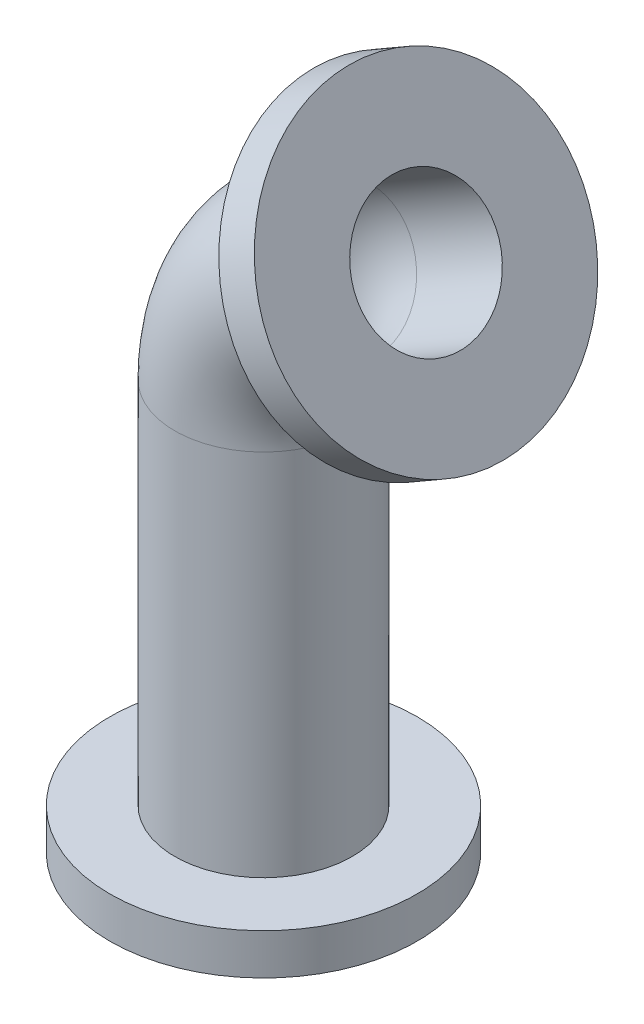
ISO-10303-21;
HEADER;
FILE_DESCRIPTION(('STEP AP214'),'2;1');
FILE_NAME('part.step','',(''),(''),'','','');
FILE_SCHEMA(('AUTOMOTIVE_DESIGN { 1 0 10303 214 1 1 1 1 }'));
ENDSEC;
DATA;
#1=APPLICATION_CONTEXT('core data for automotive mechanical design processes');
#2=APPLICATION_PROTOCOL_DEFINITION('international standard','automotive_design',2000,#1);
#3=PRODUCT_CONTEXT('',#1,'mechanical');
#4=PRODUCT('Part','Part','',(#3));
#5=PRODUCT_RELATED_PRODUCT_CATEGORY('part','',(#4));
#6=PRODUCT_DEFINITION_FORMATION('','',#4);
#7=PRODUCT_DEFINITION_CONTEXT('part definition',#1,'design');
#8=PRODUCT_DEFINITION('design','',#6,#7);
#9=PRODUCT_DEFINITION_SHAPE('','',#8);
#10=(LENGTH_UNIT() NAMED_UNIT(*) SI_UNIT(.MILLI.,.METRE.));
#11=(NAMED_UNIT(*) PLANE_ANGLE_UNIT() SI_UNIT($,.RADIAN.));
#12=(NAMED_UNIT(*) SI_UNIT($,.STERADIAN.) SOLID_ANGLE_UNIT());
#13=UNCERTAINTY_MEASURE_WITH_UNIT(LENGTH_MEASURE(1.E-05),#10,'distance_accuracy_value','');
#14=(GEOMETRIC_REPRESENTATION_CONTEXT(3) GLOBAL_UNCERTAINTY_ASSIGNED_CONTEXT((#13)) GLOBAL_UNIT_ASSIGNED_CONTEXT((#10,
#11,#12)) REPRESENTATION_CONTEXT('',''));
#15=CARTESIAN_POINT('',(0.,0.,0.));
#16=DIRECTION('',(0.,0.,1.));
#17=DIRECTION('',(1.,0.,0.));
#18=AXIS2_PLACEMENT_3D('',#15,#16,#17);
#19=CARTESIAN_POINT('',(22.5000000000001,158.9711431703,0.));
#20=DIRECTION('',(0.86602540378444,0.499999999999998,0.));
#21=DIRECTION('',(-0.499999999999998,0.86602540378444,0.));
#22=AXIS2_PLACEMENT_3D('',#19,#20,#21);
#23=CYLINDRICAL_SURFACE('',#22,26.);
#24=CARTESIAN_POINT('',(22.5000000000001,158.9711431703,0.));
#25=DIRECTION('',(0.86602540378444,0.499999999999998,0.));
#26=DIRECTION('',(-0.499999999999998,0.86602540378444,0.));
#27=AXIS2_PLACEMENT_3D('',#24,#25,#26);
#28=CIRCLE('',#27,26.);
#29=CARTESIAN_POINT('',(9.50000000000014,181.487803668695,0.));
#30=VERTEX_POINT('',#29);
#31=EDGE_CURVE('E40',#30,#30,#28,.T.);
#32=ORIENTED_EDGE('',*,*,#31,.T.);
#33=EDGE_LOOP('',(#32));
#34=FACE_BOUND('',#33,.T.);
#35=CARTESIAN_POINT('',(37.2224318643355,167.4711431703,0.));
#36=DIRECTION('',(0.86602540378444,0.499999999999998,0.));
#37=DIRECTION('',(-0.499999999999998,0.86602540378444,0.));
#38=AXIS2_PLACEMENT_3D('',#35,#36,#37);
#39=CIRCLE('',#38,26.);
#40=CARTESIAN_POINT('',(24.2224318643356,189.987803668695,0.));
#41=VERTEX_POINT('',#40);
#42=EDGE_CURVE('E66',#41,#41,#39,.F.);
#43=ORIENTED_EDGE('',*,*,#42,.T.);
#44=EDGE_LOOP('',(#43));
#45=FACE_BOUND('',#44,.T.);
#46=ADVANCED_FACE('F33',(#34,#45),#23,.T.);
#47=CARTESIAN_POINT('',(0.,120.,0.));
#48=DIRECTION('',(0.,-1.,0.));
#49=DIRECTION('',(0.,0.,-1.));
#50=AXIS2_PLACEMENT_3D('',#47,#48,#49);
#51=CYLINDRICAL_SURFACE('',#50,26.);
#52=CARTESIAN_POINT('',(0.,120.,0.));
#53=DIRECTION('',(0.,-1.,0.));
#54=DIRECTION('',(0.,0.,-1.));
#55=AXIS2_PLACEMENT_3D('',#52,#53,#54);
#56=CIRCLE('',#55,26.);
#57=CARTESIAN_POINT('',(-26.,120.,0.));
#58=VERTEX_POINT('',#57);
#59=EDGE_CURVE('E44',#58,#58,#56,.F.);
#60=ORIENTED_EDGE('',*,*,#59,.F.);
#61=EDGE_LOOP('',(#60));
#62=FACE_BOUND('',#61,.T.);
#63=CARTESIAN_POINT('',(0.,12.,0.));
#64=DIRECTION('',(0.,-1.,0.));
#65=DIRECTION('',(0.,0.,-1.));
#66=AXIS2_PLACEMENT_3D('',#63,#64,#65);
#67=CIRCLE('',#66,26.);
#68=CARTESIAN_POINT('',(0.,12.,-26.));
#69=VERTEX_POINT('',#68);
#70=EDGE_CURVE('E10',#69,#69,#67,.T.);
#71=ORIENTED_EDGE('',*,*,#70,.F.);
#72=EDGE_LOOP('',(#71));
#73=FACE_BOUND('',#72,.T.);
#74=ADVANCED_FACE('F35',(#62,#73),#51,.T.);
#75=CARTESIAN_POINT('',(45.,120.,0.));
#76=DIRECTION('',(0.,0.,-1.));
#77=DIRECTION('',(-1.,0.,0.));
#78=AXIS2_PLACEMENT_3D('',#75,#76,#77);
#79=TOROIDAL_SURFACE('',#78,45.,26.);
#80=CARTESIAN_POINT('',(45.,120.,0.));
#81=DIRECTION('',(0.,0.,-1.));
#82=DIRECTION('',(-1.,0.,0.));
#83=AXIS2_PLACEMENT_3D('',#80,#81,#82);
#84=CIRCLE('',#83,71.);
#85=EDGE_CURVE('',#58,#30,#84,.T.);
#86=ORIENTED_EDGE('',*,*,#59,.T.);
#87=ORIENTED_EDGE('',*,*,#31,.F.);
#88=ORIENTED_EDGE('',*,*,#85,.T.);
#89=ORIENTED_EDGE('',*,*,#85,.F.);
#90=EDGE_LOOP('',(#86,#88,#87,#89));
#91=FACE_BOUND('',#90,.T.);
#92=ADVANCED_FACE('F96',(#91),#79,.T.);
#93=CARTESIAN_POINT('',(47.6147367097488,173.4711431703,0.));
#94=DIRECTION('',(0.86602540378444,0.499999999999998,0.));
#95=DIRECTION('',(0.,0.,1.));
#96=AXIS2_PLACEMENT_3D('',#93,#94,#95);
#97=PLANE('',#96);
#98=CARTESIAN_POINT('',(47.6147367097488,173.4711431703,0.));
#99=DIRECTION('',(0.86602540378444,0.499999999999998,0.));
#100=DIRECTION('',(0.,0.,1.));
#101=AXIS2_PLACEMENT_3D('',#98,#99,#100);
#102=CIRCLE('',#101,20.);
#103=CARTESIAN_POINT('',(47.6147367097488,173.4711431703,20.));
#104=VERTEX_POINT('',#103);
#105=EDGE_CURVE('E49',#104,#104,#102,.T.);
#106=ORIENTED_EDGE('',*,*,#105,.F.);
#107=EDGE_LOOP('',(#106));
#108=FACE_BOUND('',#107,.T.);
#109=CARTESIAN_POINT('',(47.6147367097488,173.4711431703,0.));
#110=DIRECTION('',(0.86602540378444,0.499999999999998,0.));
#111=DIRECTION('',(-0.499999999999998,0.86602540378444,0.));
#112=AXIS2_PLACEMENT_3D('',#109,#110,#111);
#113=CIRCLE('',#112,45.);
#114=CARTESIAN_POINT('',(25.1147367097489,212.4422863406,0.));
#115=VERTEX_POINT('',#114);
#116=EDGE_CURVE('E72',#115,#115,#113,.T.);
#117=ORIENTED_EDGE('',*,*,#116,.T.);
#118=EDGE_LOOP('',(#117));
#119=FACE_BOUND('',#118,.T.);
#120=ADVANCED_FACE('F103',(#108,#119),#97,.T.);
#121=CARTESIAN_POINT('',(0.,0.,0.));
#122=DIRECTION('',(0.,1.,0.));
#123=DIRECTION('',(0.,0.,1.));
#124=AXIS2_PLACEMENT_3D('',#121,#122,#123);
#125=PLANE('',#124);
#126=CARTESIAN_POINT('',(0.,0.,0.));
#127=DIRECTION('',(0.,1.,0.));
#128=DIRECTION('',(0.,0.,1.));
#129=AXIS2_PLACEMENT_3D('',#126,#127,#128);
#130=CIRCLE('',#129,20.);
#131=CARTESIAN_POINT('',(0.,0.,20.));
#132=VERTEX_POINT('',#131);
#133=EDGE_CURVE('E57',#132,#132,#130,.T.);
#134=ORIENTED_EDGE('',*,*,#133,.T.);
#135=EDGE_LOOP('',(#134));
#136=FACE_BOUND('',#135,.T.);
#137=CARTESIAN_POINT('',(0.,0.,0.));
#138=DIRECTION('',(0.,-1.,0.));
#139=DIRECTION('',(0.,0.,-1.));
#140=AXIS2_PLACEMENT_3D('',#137,#138,#139);
#141=CIRCLE('',#140,45.);
#142=CARTESIAN_POINT('',(0.,0.,-45.));
#143=VERTEX_POINT('',#142);
#144=EDGE_CURVE('E63',#143,#143,#141,.T.);
#145=ORIENTED_EDGE('',*,*,#144,.T.);
#146=EDGE_LOOP('',(#145));
#147=FACE_BOUND('',#146,.T.);
#148=ADVANCED_FACE('F100',(#136,#147),#125,.F.);
#149=CARTESIAN_POINT('',(22.5000000000001,158.9711431703,0.));
#150=DIRECTION('',(0.86602540378444,0.499999999999998,0.));
#151=DIRECTION('',(-0.499999999999998,0.86602540378444,0.));
#152=AXIS2_PLACEMENT_3D('',#149,#150,#151);
#153=CYLINDRICAL_SURFACE('',#152,20.);
#154=ORIENTED_EDGE('',*,*,#105,.T.);
#155=EDGE_LOOP('',(#154));
#156=FACE_BOUND('',#155,.T.);
#157=CARTESIAN_POINT('',(22.5000000000001,158.9711431703,0.));
#158=DIRECTION('',(0.86602540378444,0.499999999999998,0.));
#159=DIRECTION('',(0.,0.,1.));
#160=AXIS2_PLACEMENT_3D('',#157,#158,#159);
#161=CIRCLE('',#160,20.);
#162=CARTESIAN_POINT('',(12.5000000000001,176.291651245989,0.));
#163=VERTEX_POINT('',#162);
#164=EDGE_CURVE('E53',#163,#163,#161,.T.);
#165=ORIENTED_EDGE('',*,*,#164,.F.);
#166=EDGE_LOOP('',(#165));
#167=FACE_BOUND('',#166,.T.);
#168=ADVANCED_FACE('F115',(#156,#167),#153,.F.);
#169=CARTESIAN_POINT('',(45.,120.,0.));
#170=DIRECTION('',(0.,0.,-1.));
#171=DIRECTION('',(-1.,0.,0.));
#172=AXIS2_PLACEMENT_3D('',#169,#170,#171);
#173=TOROIDAL_SURFACE('',#172,45.,20.);
#174=CARTESIAN_POINT('',(0.,120.,0.));
#175=DIRECTION('',(0.,1.,0.));
#176=DIRECTION('',(0.,0.,1.));
#177=AXIS2_PLACEMENT_3D('',#174,#175,#176);
#178=CIRCLE('',#177,20.);
#179=CARTESIAN_POINT('',(-20.,120.,0.));
#180=VERTEX_POINT('',#179);
#181=EDGE_CURVE('E56',#180,#180,#178,.T.);
#182=CARTESIAN_POINT('',(45.,120.,0.));
#183=DIRECTION('',(0.,0.,-1.));
#184=DIRECTION('',(-1.,0.,0.));
#185=AXIS2_PLACEMENT_3D('',#182,#183,#184);
#186=CIRCLE('',#185,65.);
#187=EDGE_CURVE('',#180,#163,#186,.T.);
#188=ORIENTED_EDGE('',*,*,#181,.F.);
#189=ORIENTED_EDGE('',*,*,#164,.T.);
#190=ORIENTED_EDGE('',*,*,#187,.T.);
#191=ORIENTED_EDGE('',*,*,#187,.F.);
#192=EDGE_LOOP('',(#188,#190,#189,#191));
#193=FACE_BOUND('',#192,.T.);
#194=ADVANCED_FACE('F122',(#193),#173,.F.);
#195=CARTESIAN_POINT('',(0.,120.,0.));
#196=DIRECTION('',(0.,-1.,0.));
#197=DIRECTION('',(0.,0.,-1.));
#198=AXIS2_PLACEMENT_3D('',#195,#196,#197);
#199=CYLINDRICAL_SURFACE('',#198,20.);
#200=ORIENTED_EDGE('',*,*,#181,.T.);
#201=EDGE_LOOP('',(#200));
#202=FACE_BOUND('',#201,.T.);
#203=ORIENTED_EDGE('',*,*,#133,.F.);
#204=EDGE_LOOP('',(#203));
#205=FACE_BOUND('',#204,.T.);
#206=ADVANCED_FACE('F126',(#202,#205),#199,.F.);
#207=CARTESIAN_POINT('',(0.,12.,0.));
#208=DIRECTION('',(0.,-1.,0.));
#209=DIRECTION('',(0.,0.,-1.));
#210=AXIS2_PLACEMENT_3D('',#207,#208,#209);
#211=CYLINDRICAL_SURFACE('',#210,45.);
#212=CARTESIAN_POINT('',(0.,12.,0.));
#213=DIRECTION('',(0.,-1.,0.));
#214=DIRECTION('',(0.,0.,-1.));
#215=AXIS2_PLACEMENT_3D('',#212,#213,#214);
#216=CIRCLE('',#215,45.);
#217=CARTESIAN_POINT('',(0.,12.,-45.));
#218=VERTEX_POINT('',#217);
#219=EDGE_CURVE('E60',#218,#218,#216,.T.);
#220=ORIENTED_EDGE('',*,*,#219,.T.);
#221=EDGE_LOOP('',(#220));
#222=FACE_BOUND('',#221,.T.);
#223=ORIENTED_EDGE('',*,*,#144,.F.);
#224=EDGE_LOOP('',(#223));
#225=FACE_BOUND('',#224,.T.);
#226=ADVANCED_FACE('F130',(#222,#225),#211,.T.);
#227=CARTESIAN_POINT('',(0.,12.,0.));
#228=DIRECTION('',(0.,-1.,0.));
#229=DIRECTION('',(0.,0.,-1.));
#230=AXIS2_PLACEMENT_3D('',#227,#228,#229);
#231=PLANE('',#230);
#232=ORIENTED_EDGE('',*,*,#70,.T.);
#233=EDGE_LOOP('',(#232));
#234=FACE_BOUND('',#233,.T.);
#235=ORIENTED_EDGE('',*,*,#219,.F.);
#236=EDGE_LOOP('',(#235));
#237=FACE_BOUND('',#236,.T.);
#238=ADVANCED_FACE('F88',(#234,#237),#231,.F.);
#239=CARTESIAN_POINT('',(37.2224318643355,167.4711431703,0.));
#240=DIRECTION('',(0.86602540378444,0.499999999999998,0.));
#241=DIRECTION('',(-0.499999999999998,0.86602540378444,0.));
#242=AXIS2_PLACEMENT_3D('',#239,#240,#241);
#243=CYLINDRICAL_SURFACE('',#242,45.);
#244=CARTESIAN_POINT('',(37.2224318643355,167.4711431703,0.));
#245=DIRECTION('',(0.86602540378444,0.499999999999998,0.));
#246=DIRECTION('',(-0.499999999999998,0.86602540378444,0.));
#247=AXIS2_PLACEMENT_3D('',#244,#245,#246);
#248=CIRCLE('',#247,45.);
#249=CARTESIAN_POINT('',(14.7224318643356,206.4422863406,0.));
#250=VERTEX_POINT('',#249);
#251=EDGE_CURVE('E71',#250,#250,#248,.T.);
#252=ORIENTED_EDGE('',*,*,#251,.T.);
#253=EDGE_LOOP('',(#252));
#254=FACE_BOUND('',#253,.T.);
#255=ORIENTED_EDGE('',*,*,#116,.F.);
#256=EDGE_LOOP('',(#255));
#257=FACE_BOUND('',#256,.T.);
#258=ADVANCED_FACE('F78',(#254,#257),#243,.T.);
#259=CARTESIAN_POINT('',(37.2224318643355,167.4711431703,0.));
#260=DIRECTION('',(0.86602540378444,0.499999999999998,0.));
#261=DIRECTION('',(-0.499999999999998,0.86602540378444,0.));
#262=AXIS2_PLACEMENT_3D('',#259,#260,#261);
#263=PLANE('',#262);
#264=ORIENTED_EDGE('',*,*,#42,.F.);
#265=EDGE_LOOP('',(#264));
#266=FACE_BOUND('',#265,.T.);
#267=ORIENTED_EDGE('',*,*,#251,.F.);
#268=EDGE_LOOP('',(#267));
#269=FACE_BOUND('',#268,.T.);
#270=ADVANCED_FACE('F81',(#266,#269),#263,.F.);
#271=CLOSED_SHELL('',(#46,#74,#92,#120,#148,#168,#194,#206,#226,#238,#258,#270));
#272=MANIFOLD_SOLID_BREP('B2',#271);
#273=ADVANCED_BREP_SHAPE_REPRESENTATION('',(#18,#272),#14);
#274=SHAPE_DEFINITION_REPRESENTATION(#9,#273);
ENDSEC;
END-ISO-10303-21;
